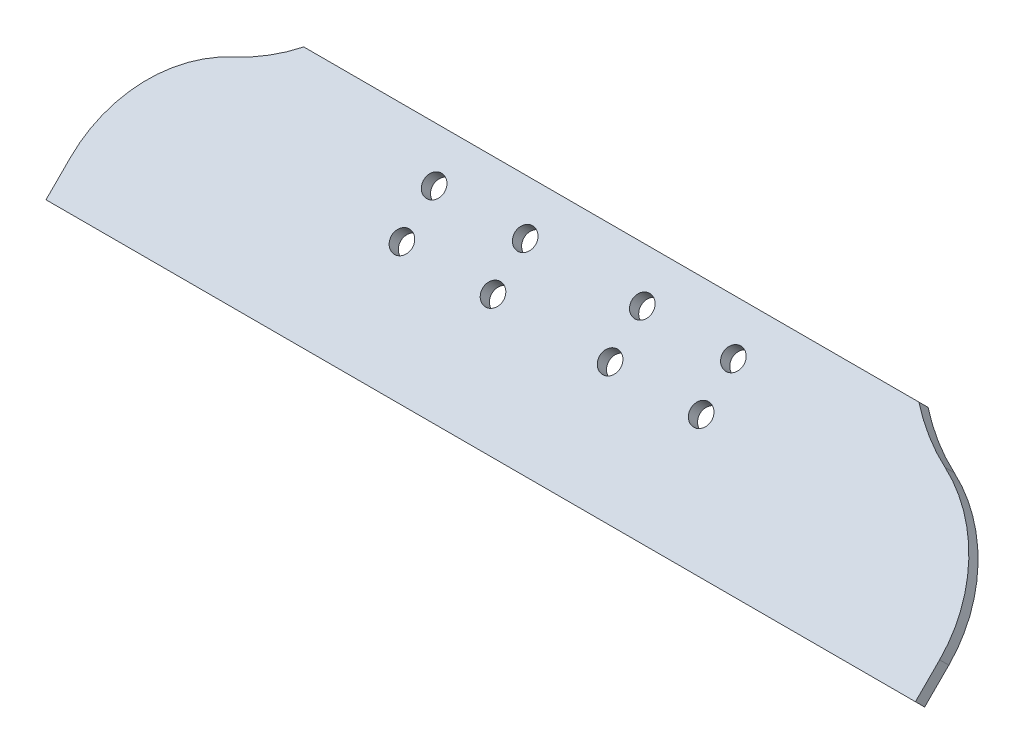
ISO-10303-21;
HEADER;
FILE_DESCRIPTION(('STEP AP214'),'2;1');
FILE_NAME('part.step','',(''),(''),'','','');
FILE_SCHEMA(('AUTOMOTIVE_DESIGN { 1 0 10303 214 1 1 1 1 }'));
ENDSEC;
DATA;
#1=APPLICATION_CONTEXT('core data for automotive mechanical design processes');
#2=APPLICATION_PROTOCOL_DEFINITION('international standard','automotive_design',2000,#1);
#3=PRODUCT_CONTEXT('',#1,'mechanical');
#4=PRODUCT('Part','Part','',(#3));
#5=PRODUCT_RELATED_PRODUCT_CATEGORY('part','',(#4));
#6=PRODUCT_DEFINITION_FORMATION('','',#4);
#7=PRODUCT_DEFINITION_CONTEXT('part definition',#1,'design');
#8=PRODUCT_DEFINITION('design','',#6,#7);
#9=PRODUCT_DEFINITION_SHAPE('','',#8);
#10=(LENGTH_UNIT() NAMED_UNIT(*) SI_UNIT(.MILLI.,.METRE.));
#11=(NAMED_UNIT(*) PLANE_ANGLE_UNIT() SI_UNIT($,.RADIAN.));
#12=(NAMED_UNIT(*) SI_UNIT($,.STERADIAN.) SOLID_ANGLE_UNIT());
#13=UNCERTAINTY_MEASURE_WITH_UNIT(LENGTH_MEASURE(1.E-05),#10,'distance_accuracy_value','');
#14=(GEOMETRIC_REPRESENTATION_CONTEXT(3) GLOBAL_UNCERTAINTY_ASSIGNED_CONTEXT((#13)) GLOBAL_UNIT_ASSIGNED_CONTEXT((#10,
#11,#12)) REPRESENTATION_CONTEXT('',''));
#15=CARTESIAN_POINT('',(0.,0.,0.));
#16=DIRECTION('',(0.,0.,1.));
#17=DIRECTION('',(1.,0.,0.));
#18=AXIS2_PLACEMENT_3D('',#15,#16,#17);
#19=CARTESIAN_POINT('',(74.3401280605345,5.90533644918669,66.8472916113481));
#20=DIRECTION('',(0.,0.707106781186551,0.707106781186544));
#21=DIRECTION('',(0.,-0.707106781186544,0.707106781186551));
#22=AXIS2_PLACEMENT_3D('',#19,#20,#21);
#23=PLANE('',#22);
#24=CARTESIAN_POINT('',(-36.5125,17.2869930330582,55.4656350274765));
#25=DIRECTION('',(0.,0.707106781186551,0.707106781186544));
#26=DIRECTION('',(0.,-0.707106781186544,0.707106781186551));
#27=AXIS2_PLACEMENT_3D('',#24,#25,#26);
#28=CIRCLE('',#27,2.5527);
#29=CARTESIAN_POINT('',(-36.5125,15.4819615527233,57.2706665078114));
#30=VERTEX_POINT('',#29);
#31=EDGE_CURVE('E377',#30,#30,#28,.T.);
#32=ORIENTED_EDGE('',*,*,#31,.F.);
#33=EDGE_LOOP('',(#32));
#34=FACE_BOUND('',#33,.T.);
#35=CARTESIAN_POINT('',(36.5125,25.1447171389936,47.607910921541));
#36=DIRECTION('',(0.,0.707106781186551,0.707106781186544));
#37=DIRECTION('',(0.,-0.707106781186544,0.707106781186551));
#38=AXIS2_PLACEMENT_3D('',#35,#36,#37);
#39=CIRCLE('',#38,2.5527);
#40=CARTESIAN_POINT('',(36.5125,23.3396856586588,49.4129424018759));
#41=VERTEX_POINT('',#40);
#42=EDGE_CURVE('E378',#41,#41,#39,.T.);
#43=ORIENTED_EDGE('',*,*,#42,.F.);
#44=EDGE_LOOP('',(#43));
#45=FACE_BOUND('',#44,.T.);
#46=CARTESIAN_POINT('',(14.2875,25.1447171389936,47.607910921541));
#47=DIRECTION('',(0.,0.707106781186551,0.707106781186544));
#48=DIRECTION('',(0.,-0.707106781186544,0.707106781186551));
#49=AXIS2_PLACEMENT_3D('',#46,#47,#48);
#50=CIRCLE('',#49,2.5527);
#51=CARTESIAN_POINT('',(14.2875,23.3396856586588,49.4129424018759));
#52=VERTEX_POINT('',#51);
#53=EDGE_CURVE('E382',#52,#52,#50,.T.);
#54=ORIENTED_EDGE('',*,*,#53,.F.);
#55=EDGE_LOOP('',(#54));
#56=FACE_BOUND('',#55,.T.);
#57=CARTESIAN_POINT('',(-14.2875,25.1447171389936,47.607910921541));
#58=DIRECTION('',(0.,0.707106781186551,0.707106781186544));
#59=DIRECTION('',(0.,-0.707106781186544,0.707106781186551));
#60=AXIS2_PLACEMENT_3D('',#57,#58,#59);
#61=CIRCLE('',#60,2.5527);
#62=CARTESIAN_POINT('',(-14.2875,23.3396856586588,49.4129424018759));
#63=VERTEX_POINT('',#62);
#64=EDGE_CURVE('E389',#63,#63,#61,.T.);
#65=ORIENTED_EDGE('',*,*,#64,.F.);
#66=EDGE_LOOP('',(#65));
#67=FACE_BOUND('',#66,.T.);
#68=CARTESIAN_POINT('',(-14.2875,17.2869930330582,55.4656350274765));
#69=DIRECTION('',(0.,0.707106781186551,0.707106781186544));
#70=DIRECTION('',(0.,-0.707106781186544,0.707106781186551));
#71=AXIS2_PLACEMENT_3D('',#68,#69,#70);
#72=CIRCLE('',#71,2.5527);
#73=CARTESIAN_POINT('',(-14.2875,15.4819615527233,57.2706665078114));
#74=VERTEX_POINT('',#73);
#75=EDGE_CURVE('E379',#74,#74,#72,.T.);
#76=ORIENTED_EDGE('',*,*,#75,.F.);
#77=EDGE_LOOP('',(#76));
#78=FACE_BOUND('',#77,.T.);
#79=CARTESIAN_POINT('',(14.2875,17.2869930330582,55.4656350274765));
#80=DIRECTION('',(0.,0.707106781186551,0.707106781186544));
#81=DIRECTION('',(0.,-0.707106781186544,0.707106781186551));
#82=AXIS2_PLACEMENT_3D('',#79,#80,#81);
#83=CIRCLE('',#82,2.5527);
#84=CARTESIAN_POINT('',(14.2875,15.4819615527233,57.2706665078114));
#85=VERTEX_POINT('',#84);
#86=EDGE_CURVE('E385',#85,#85,#83,.T.);
#87=ORIENTED_EDGE('',*,*,#86,.F.);
#88=EDGE_LOOP('',(#87));
#89=FACE_BOUND('',#88,.T.);
#90=CARTESIAN_POINT('',(36.5125,17.2869930330582,55.4656350274765));
#91=DIRECTION('',(0.,0.707106781186551,0.707106781186544));
#92=DIRECTION('',(0.,-0.707106781186544,0.707106781186551));
#93=AXIS2_PLACEMENT_3D('',#90,#91,#92);
#94=CIRCLE('',#93,2.5527);
#95=CARTESIAN_POINT('',(36.5125,15.4819615527233,57.2706665078114));
#96=VERTEX_POINT('',#95);
#97=EDGE_CURVE('E406',#96,#96,#94,.T.);
#98=ORIENTED_EDGE('',*,*,#97,.F.);
#99=EDGE_LOOP('',(#98));
#100=FACE_BOUND('',#99,.T.);
#101=CARTESIAN_POINT('',(-36.5125,25.1447171389936,47.607910921541));
#102=DIRECTION('',(0.,0.707106781186551,0.707106781186544));
#103=DIRECTION('',(0.,-0.707106781186544,0.707106781186551));
#104=AXIS2_PLACEMENT_3D('',#101,#102,#103);
#105=CIRCLE('',#104,2.5527);
#106=CARTESIAN_POINT('',(-36.5125,23.3396856586588,49.4129424018759));
#107=VERTEX_POINT('',#106);
#108=EDGE_CURVE('E160',#107,#107,#105,.T.);
#109=ORIENTED_EDGE('',*,*,#108,.F.);
#110=EDGE_LOOP('',(#109));
#111=FACE_BOUND('',#110,.T.);
#112=DIRECTION('',(-1.,0.,0.));
#113=VECTOR('',#112,1.);
#114=CARTESIAN_POINT('',(22.86,31.8799092297955,40.8727188307391));
#115=LINE('',#114,#113);
#116=CARTESIAN_POINT('',(75.0523471244315,31.8799092297955,40.8727188307391));
#117=VERTEX_POINT('',#116);
#118=CARTESIAN_POINT('',(-75.0523471244315,31.8799092297955,40.8727188307391));
#119=VERTEX_POINT('',#118);
#120=EDGE_CURVE('E112',#117,#119,#115,.T.);
#121=ORIENTED_EDGE('',*,*,#120,.T.);
#122=CARTESIAN_POINT('',(-102.892624920902,53.4484360429933,19.304192017541));
#123=DIRECTION('',(0.,-0.707106781186551,-0.707106781186544));
#124=DIRECTION('',(0.,-0.707106781186544,0.707106781186551));
#125=AXIS2_PLACEMENT_3D('',#122,#123,#124);
#126=CIRCLE('',#125,41.2975031396323);
#127=CARTESIAN_POINT('',(-86.7504328122766,26.5698813990383,46.1827466614963));
#128=VERTEX_POINT('',#127);
#129=EDGE_CURVE('E104',#119,#128,#126,.T.);
#130=ORIENTED_EDGE('',*,*,#129,.T.);
#131=CARTESIAN_POINT('',(-74.3401280605345,5.90533644918669,66.8472916113481));
#132=DIRECTION('',(0.,0.707106781186551,0.707106781186544));
#133=DIRECTION('',(0.,-0.707106781186544,0.707106781186551));
#134=AXIS2_PLACEMENT_3D('',#131,#132,#133);
#135=CIRCLE('',#134,31.75);
#136=CARTESIAN_POINT('',(-106.090128060535,5.90533644918669,66.8472916113481));
#137=VERTEX_POINT('',#136);
#138=EDGE_CURVE('E107',#128,#137,#135,.T.);
#139=ORIENTED_EDGE('',*,*,#138,.T.);
#140=DIRECTION('',(0.,-0.707106781186544,0.707106781186551));
#141=VECTOR('',#140,1.);
#142=CARTESIAN_POINT('',(-106.090128060535,5.90533644918669,66.8472916113481));
#143=LINE('',#142,#141);
#144=CARTESIAN_POINT('',(-106.090128060535,1.58293517182884E-13,72.7526280605347));
#145=VERTEX_POINT('',#144);
#146=EDGE_CURVE('E58',#137,#145,#143,.T.);
#147=ORIENTED_EDGE('',*,*,#146,.T.);
#148=DIRECTION('',(1.,0.,0.));
#149=VECTOR('',#148,1.);
#150=CARTESIAN_POINT('',(-106.090128060535,1.58293517182884E-13,72.7526280605347));
#151=LINE('',#150,#149);
#152=CARTESIAN_POINT('',(106.090128060535,1.61762964134837E-13,72.7526280605347));
#153=VERTEX_POINT('',#152);
#154=EDGE_CURVE('E147',#145,#153,#151,.T.);
#155=ORIENTED_EDGE('',*,*,#154,.T.);
#156=DIRECTION('',(0.,0.707106781186543,-0.707106781186552));
#157=VECTOR('',#156,1.);
#158=CARTESIAN_POINT('',(106.090128060535,1.61762964134837E-13,72.7526280605347));
#159=LINE('',#158,#157);
#160=CARTESIAN_POINT('',(106.090128060535,5.90533644918668,66.8472916113481));
#161=VERTEX_POINT('',#160);
#162=EDGE_CURVE('E94',#153,#161,#159,.T.);
#163=ORIENTED_EDGE('',*,*,#162,.T.);
#164=CARTESIAN_POINT('',(74.3401280605345,5.90533644918669,66.8472916113481));
#165=DIRECTION('',(0.,0.707106781186551,0.707106781186544));
#166=DIRECTION('',(0.,-0.707106781186544,0.707106781186551));
#167=AXIS2_PLACEMENT_3D('',#164,#165,#166);
#168=CIRCLE('',#167,31.75);
#169=CARTESIAN_POINT('',(86.7504328122767,26.5698813990383,46.1827466614963));
#170=VERTEX_POINT('',#169);
#171=EDGE_CURVE('E191',#161,#170,#168,.T.);
#172=ORIENTED_EDGE('',*,*,#171,.T.);
#173=CARTESIAN_POINT('',(102.892624920902,53.4484360429933,19.304192017541));
#174=DIRECTION('',(0.,-0.707106781186551,-0.707106781186544));
#175=DIRECTION('',(0.,-0.707106781186544,0.707106781186551));
#176=AXIS2_PLACEMENT_3D('',#173,#174,#175);
#177=CIRCLE('',#176,41.2975031396323);
#178=EDGE_CURVE('E193',#170,#117,#177,.T.);
#179=ORIENTED_EDGE('',*,*,#178,.T.);
#180=EDGE_LOOP('',(#121,#130,#139,#147,#155,#163,#172,#179));
#181=FACE_BOUND('',#180,.T.);
#182=ADVANCED_FACE('F33',(#34,#45,#56,#67,#78,#89,#100,#111,#181),#23,.T.);
#183=CARTESIAN_POINT('',(74.3401280605345,3.66027241891939,64.6022275810809));
#184=DIRECTION('',(0.,0.707106781186551,0.707106781186544));
#185=DIRECTION('',(0.,-0.707106781186544,0.707106781186551));
#186=AXIS2_PLACEMENT_3D('',#183,#184,#185);
#187=PLANE('',#186);
#188=CARTESIAN_POINT('',(-36.5125,15.0419290027909,53.2205709972093));
#189=DIRECTION('',(0.,0.707106781186551,0.707106781186544));
#190=DIRECTION('',(0.,-0.707106781186544,0.707106781186551));
#191=AXIS2_PLACEMENT_3D('',#188,#189,#190);
#192=CIRCLE('',#191,2.5527);
#193=CARTESIAN_POINT('',(-36.5125,13.236897522456,55.0256024775442));
#194=VERTEX_POINT('',#193);
#195=EDGE_CURVE('E37',#194,#194,#192,.T.);
#196=ORIENTED_EDGE('',*,*,#195,.T.);
#197=EDGE_LOOP('',(#196));
#198=FACE_BOUND('',#197,.T.);
#199=CARTESIAN_POINT('',(36.5125,22.8996531087263,45.3628468912737));
#200=DIRECTION('',(0.,0.707106781186551,0.707106781186544));
#201=DIRECTION('',(0.,-0.707106781186544,0.707106781186551));
#202=AXIS2_PLACEMENT_3D('',#199,#200,#201);
#203=CIRCLE('',#202,2.5527);
#204=CARTESIAN_POINT('',(36.5125,21.0946216283914,47.1678783716086));
#205=VERTEX_POINT('',#204);
#206=EDGE_CURVE('E174',#205,#205,#203,.T.);
#207=ORIENTED_EDGE('',*,*,#206,.T.);
#208=EDGE_LOOP('',(#207));
#209=FACE_BOUND('',#208,.T.);
#210=CARTESIAN_POINT('',(14.2875,22.8996531087263,45.3628468912737));
#211=DIRECTION('',(0.,0.707106781186551,0.707106781186544));
#212=DIRECTION('',(0.,-0.707106781186544,0.707106781186551));
#213=AXIS2_PLACEMENT_3D('',#210,#211,#212);
#214=CIRCLE('',#213,2.5527);
#215=CARTESIAN_POINT('',(14.2875,21.0946216283914,47.1678783716086));
#216=VERTEX_POINT('',#215);
#217=EDGE_CURVE('E172',#216,#216,#214,.T.);
#218=ORIENTED_EDGE('',*,*,#217,.T.);
#219=EDGE_LOOP('',(#218));
#220=FACE_BOUND('',#219,.T.);
#221=CARTESIAN_POINT('',(-14.2875,22.8996531087263,45.3628468912737));
#222=DIRECTION('',(0.,0.707106781186551,0.707106781186544));
#223=DIRECTION('',(0.,-0.707106781186544,0.707106781186551));
#224=AXIS2_PLACEMENT_3D('',#221,#222,#223);
#225=CIRCLE('',#224,2.5527);
#226=CARTESIAN_POINT('',(-14.2875,21.0946216283914,47.1678783716086));
#227=VERTEX_POINT('',#226);
#228=EDGE_CURVE('E169',#227,#227,#225,.T.);
#229=ORIENTED_EDGE('',*,*,#228,.T.);
#230=EDGE_LOOP('',(#229));
#231=FACE_BOUND('',#230,.T.);
#232=CARTESIAN_POINT('',(-14.2875,15.0419290027909,53.2205709972093));
#233=DIRECTION('',(0.,0.707106781186551,0.707106781186544));
#234=DIRECTION('',(0.,-0.707106781186544,0.707106781186551));
#235=AXIS2_PLACEMENT_3D('',#232,#233,#234);
#236=CIRCLE('',#235,2.5527);
#237=CARTESIAN_POINT('',(-14.2875,13.236897522456,55.0256024775442));
#238=VERTEX_POINT('',#237);
#239=EDGE_CURVE('E166',#238,#238,#236,.T.);
#240=ORIENTED_EDGE('',*,*,#239,.T.);
#241=EDGE_LOOP('',(#240));
#242=FACE_BOUND('',#241,.T.);
#243=CARTESIAN_POINT('',(14.2875,15.0419290027909,53.2205709972093));
#244=DIRECTION('',(0.,0.707106781186551,0.707106781186544));
#245=DIRECTION('',(0.,-0.707106781186544,0.707106781186551));
#246=AXIS2_PLACEMENT_3D('',#243,#244,#245);
#247=CIRCLE('',#246,2.5527);
#248=CARTESIAN_POINT('',(14.2875,13.236897522456,55.0256024775442));
#249=VERTEX_POINT('',#248);
#250=EDGE_CURVE('E163',#249,#249,#247,.T.);
#251=ORIENTED_EDGE('',*,*,#250,.T.);
#252=EDGE_LOOP('',(#251));
#253=FACE_BOUND('',#252,.T.);
#254=CARTESIAN_POINT('',(36.5125,15.0419290027909,53.2205709972093));
#255=DIRECTION('',(0.,0.707106781186551,0.707106781186544));
#256=DIRECTION('',(0.,-0.707106781186544,0.707106781186551));
#257=AXIS2_PLACEMENT_3D('',#254,#255,#256);
#258=CIRCLE('',#257,2.5527);
#259=CARTESIAN_POINT('',(36.5125,13.236897522456,55.0256024775442));
#260=VERTEX_POINT('',#259);
#261=EDGE_CURVE('E159',#260,#260,#258,.T.);
#262=ORIENTED_EDGE('',*,*,#261,.T.);
#263=EDGE_LOOP('',(#262));
#264=FACE_BOUND('',#263,.T.);
#265=CARTESIAN_POINT('',(-36.5125,22.8996531087263,45.3628468912737));
#266=DIRECTION('',(0.,0.707106781186551,0.707106781186544));
#267=DIRECTION('',(0.,-0.707106781186544,0.707106781186551));
#268=AXIS2_PLACEMENT_3D('',#265,#266,#267);
#269=CIRCLE('',#268,2.5527);
#270=CARTESIAN_POINT('',(-36.5125,21.0946216283914,47.1678783716086));
#271=VERTEX_POINT('',#270);
#272=EDGE_CURVE('E156',#271,#271,#269,.T.);
#273=ORIENTED_EDGE('',*,*,#272,.T.);
#274=EDGE_LOOP('',(#273));
#275=FACE_BOUND('',#274,.T.);
#276=CARTESIAN_POINT('',(-102.892624920902,51.203372012726,17.0591279872737));
#277=DIRECTION('',(0.,-0.707106781186551,-0.707106781186544));
#278=DIRECTION('',(0.,-0.707106781186544,0.707106781186551));
#279=AXIS2_PLACEMENT_3D('',#276,#277,#278);
#280=CIRCLE('',#279,41.2975031396323);
#281=CARTESIAN_POINT('',(-75.0523471244315,29.6348451995282,38.6276548004718));
#282=VERTEX_POINT('',#281);
#283=CARTESIAN_POINT('',(-86.7504328122766,24.324817368771,43.937682631229));
#284=VERTEX_POINT('',#283);
#285=EDGE_CURVE('E119',#282,#284,#280,.T.);
#286=ORIENTED_EDGE('',*,*,#285,.F.);
#287=DIRECTION('',(-1.,0.,0.));
#288=VECTOR('',#287,1.);
#289=CARTESIAN_POINT('',(22.86,29.6348451995282,38.6276548004718));
#290=LINE('',#289,#288);
#291=CARTESIAN_POINT('',(75.0523471244315,29.6348451995282,38.6276548004718));
#292=VERTEX_POINT('',#291);
#293=EDGE_CURVE('E50',#292,#282,#290,.T.);
#294=ORIENTED_EDGE('',*,*,#293,.F.);
#295=CARTESIAN_POINT('',(102.892624920902,51.203372012726,17.0591279872737));
#296=DIRECTION('',(0.,-0.707106781186551,-0.707106781186544));
#297=DIRECTION('',(0.,-0.707106781186544,0.707106781186551));
#298=AXIS2_PLACEMENT_3D('',#295,#296,#297);
#299=CIRCLE('',#298,41.2975031396323);
#300=CARTESIAN_POINT('',(86.7504328122767,24.324817368771,43.937682631229));
#301=VERTEX_POINT('',#300);
#302=EDGE_CURVE('E139',#301,#292,#299,.T.);
#303=ORIENTED_EDGE('',*,*,#302,.F.);
#304=CARTESIAN_POINT('',(74.3401280605345,3.66027241891939,64.6022275810809));
#305=DIRECTION('',(0.,0.707106781186551,0.707106781186544));
#306=DIRECTION('',(0.,-0.707106781186544,0.707106781186551));
#307=AXIS2_PLACEMENT_3D('',#304,#305,#306);
#308=CIRCLE('',#307,31.75);
#309=CARTESIAN_POINT('',(106.090128060535,3.66027241891938,64.6022275810809));
#310=VERTEX_POINT('',#309);
#311=EDGE_CURVE('E137',#310,#301,#308,.T.);
#312=ORIENTED_EDGE('',*,*,#311,.F.);
#313=DIRECTION('',(0.,0.707106781186543,-0.707106781186552));
#314=VECTOR('',#313,1.);
#315=CARTESIAN_POINT('',(106.090128060535,-2.24506403026714,70.5075640302674));
#316=LINE('',#315,#314);
#317=CARTESIAN_POINT('',(106.090128060535,-2.24506403026714,70.5075640302674));
#318=VERTEX_POINT('',#317);
#319=EDGE_CURVE('E134',#318,#310,#316,.T.);
#320=ORIENTED_EDGE('',*,*,#319,.F.);
#321=DIRECTION('',(1.,0.,0.));
#322=VECTOR('',#321,1.);
#323=CARTESIAN_POINT('',(-106.090128060535,-2.24506403026714,70.5075640302674));
#324=LINE('',#323,#322);
#325=CARTESIAN_POINT('',(-106.090128060535,-2.24506403026714,70.5075640302674));
#326=VERTEX_POINT('',#325);
#327=EDGE_CURVE('E131',#326,#318,#324,.T.);
#328=ORIENTED_EDGE('',*,*,#327,.F.);
#329=DIRECTION('',(0.,-0.707106781186544,0.707106781186551));
#330=VECTOR('',#329,1.);
#331=CARTESIAN_POINT('',(-106.090128060535,3.66027241891938,64.6022275810809));
#332=LINE('',#331,#330);
#333=CARTESIAN_POINT('',(-106.090128060535,3.66027241891939,64.6022275810809));
#334=VERTEX_POINT('',#333);
#335=EDGE_CURVE('E85',#334,#326,#332,.T.);
#336=ORIENTED_EDGE('',*,*,#335,.F.);
#337=CARTESIAN_POINT('',(-74.3401280605345,3.66027241891938,64.6022275810809));
#338=DIRECTION('',(0.,0.707106781186551,0.707106781186544));
#339=DIRECTION('',(0.,-0.707106781186544,0.707106781186551));
#340=AXIS2_PLACEMENT_3D('',#337,#338,#339);
#341=CIRCLE('',#340,31.75);
#342=EDGE_CURVE('E144',#284,#334,#341,.T.);
#343=ORIENTED_EDGE('',*,*,#342,.F.);
#344=EDGE_LOOP('',(#286,#294,#303,#312,#320,#328,#336,#343));
#345=FACE_BOUND('',#344,.T.);
#346=ADVANCED_FACE('F201',(#198,#209,#220,#231,#242,#253,#264,#275,#345),#187,.F.);
#347=CARTESIAN_POINT('',(-106.090128060535,1.58293517182884E-13,72.7526280605347));
#348=DIRECTION('',(0.,0.707106781186543,-0.707106781186551));
#349=DIRECTION('',(0.,0.707106781186551,0.707106781186544));
#350=AXIS2_PLACEMENT_3D('',#347,#348,#349);
#351=PLANE('',#350);
#352=ORIENTED_EDGE('',*,*,#327,.T.);
#353=DIRECTION('',(0.,-0.707106781186551,-0.707106781186543));
#354=VECTOR('',#353,1.);
#355=CARTESIAN_POINT('',(106.090128060535,1.61762964134837E-13,72.7526280605347));
#356=LINE('',#355,#354);
#357=EDGE_CURVE('E42',#153,#318,#356,.T.);
#358=ORIENTED_EDGE('',*,*,#357,.F.);
#359=ORIENTED_EDGE('',*,*,#154,.F.);
#360=DIRECTION('',(0.,-0.707106781186551,-0.707106781186543));
#361=VECTOR('',#360,1.);
#362=CARTESIAN_POINT('',(-106.090128060535,1.58293517182884E-13,72.7526280605347));
#363=LINE('',#362,#361);
#364=EDGE_CURVE('E127',#145,#326,#363,.T.);
#365=ORIENTED_EDGE('',*,*,#364,.T.);
#366=EDGE_LOOP('',(#352,#358,#359,#365));
#367=FACE_BOUND('',#366,.T.);
#368=ADVANCED_FACE('F35',(#367),#351,.F.);
#369=CARTESIAN_POINT('',(106.090128060535,1.61762964134837E-13,72.7526280605347));
#370=DIRECTION('',(-1.,0.,0.));
#371=DIRECTION('',(0.,0.,1.));
#372=AXIS2_PLACEMENT_3D('',#369,#370,#371);
#373=PLANE('',#372);
#374=ORIENTED_EDGE('',*,*,#319,.T.);
#375=DIRECTION('',(0.,-0.707106781186551,-0.707106781186543));
#376=VECTOR('',#375,1.);
#377=CARTESIAN_POINT('',(106.090128060535,5.90533644918668,66.8472916113481));
#378=LINE('',#377,#376);
#379=EDGE_CURVE('E152',#161,#310,#378,.T.);
#380=ORIENTED_EDGE('',*,*,#379,.F.);
#381=ORIENTED_EDGE('',*,*,#162,.F.);
#382=ORIENTED_EDGE('',*,*,#357,.T.);
#383=EDGE_LOOP('',(#374,#380,#381,#382));
#384=FACE_BOUND('',#383,.T.);
#385=ADVANCED_FACE('F318',(#384),#373,.F.);
#386=CARTESIAN_POINT('',(74.3401280605345,5.90533644918669,66.8472916113481));
#387=DIRECTION('',(0.,-0.707106781186551,-0.707106781186543));
#388=DIRECTION('',(0.,0.707106781186544,-0.707106781186551));
#389=AXIS2_PLACEMENT_3D('',#386,#387,#388);
#390=CYLINDRICAL_SURFACE('',#389,31.75);
#391=ORIENTED_EDGE('',*,*,#311,.T.);
#392=DIRECTION('',(0.,-0.707106781186551,-0.707106781186543));
#393=VECTOR('',#392,1.);
#394=CARTESIAN_POINT('',(86.7504328122767,26.5698813990383,46.1827466614963));
#395=LINE('',#394,#393);
#396=EDGE_CURVE('E122',#170,#301,#395,.T.);
#397=ORIENTED_EDGE('',*,*,#396,.F.);
#398=ORIENTED_EDGE('',*,*,#171,.F.);
#399=ORIENTED_EDGE('',*,*,#379,.T.);
#400=EDGE_LOOP('',(#391,#397,#398,#399));
#401=FACE_BOUND('',#400,.T.);
#402=ADVANCED_FACE('F211',(#401),#390,.T.);
#403=CARTESIAN_POINT('',(102.892624920902,53.4484360429933,19.304192017541));
#404=DIRECTION('',(0.,-0.707106781186551,-0.707106781186543));
#405=DIRECTION('',(0.,0.707106781186544,-0.707106781186551));
#406=AXIS2_PLACEMENT_3D('',#403,#404,#405);
#407=CYLINDRICAL_SURFACE('',#406,41.2975031396323);
#408=ORIENTED_EDGE('',*,*,#302,.T.);
#409=DIRECTION('',(0.,0.707106781186551,0.707106781186544));
#410=VECTOR('',#409,1.);
#411=CARTESIAN_POINT('',(75.0523471244315,-27.0501868156056,-18.0573772146613));
#412=LINE('',#411,#410);
#413=EDGE_CURVE('E135',#292,#117,#412,.T.);
#414=ORIENTED_EDGE('',*,*,#413,.T.);
#415=ORIENTED_EDGE('',*,*,#178,.F.);
#416=ORIENTED_EDGE('',*,*,#396,.T.);
#417=EDGE_LOOP('',(#408,#414,#415,#416));
#418=FACE_BOUND('',#417,.T.);
#419=ADVANCED_FACE('F196',(#418),#407,.F.);
#420=CARTESIAN_POINT('',(22.86,31.8799092297955,40.8727188307391));
#421=DIRECTION('',(0.,-0.707106781186543,0.707106781186551));
#422=DIRECTION('',(0.,-0.707106781186551,-0.707106781186544));
#423=AXIS2_PLACEMENT_3D('',#420,#421,#422);
#424=PLANE('',#423);
#425=ORIENTED_EDGE('',*,*,#293,.T.);
#426=DIRECTION('',(0.,-0.707106781186551,-0.707106781186543));
#427=VECTOR('',#426,1.);
#428=CARTESIAN_POINT('',(-75.0523471244315,31.8799092297955,40.8727188307391));
#429=LINE('',#428,#427);
#430=EDGE_CURVE('E11',#119,#282,#429,.T.);
#431=ORIENTED_EDGE('',*,*,#430,.F.);
#432=ORIENTED_EDGE('',*,*,#120,.F.);
#433=ORIENTED_EDGE('',*,*,#413,.F.);
#434=EDGE_LOOP('',(#425,#431,#432,#433));
#435=FACE_BOUND('',#434,.T.);
#436=ADVANCED_FACE('F202',(#435),#424,.F.);
#437=CARTESIAN_POINT('',(-102.892624920902,53.4484360429933,19.304192017541));
#438=DIRECTION('',(0.,-0.707106781186551,-0.707106781186543));
#439=DIRECTION('',(0.,0.707106781186544,-0.707106781186551));
#440=AXIS2_PLACEMENT_3D('',#437,#438,#439);
#441=CYLINDRICAL_SURFACE('',#440,41.2975031396323);
#442=ORIENTED_EDGE('',*,*,#129,.F.);
#443=ORIENTED_EDGE('',*,*,#430,.T.);
#444=ORIENTED_EDGE('',*,*,#285,.T.);
#445=DIRECTION('',(0.,-0.707106781186551,-0.707106781186543));
#446=VECTOR('',#445,1.);
#447=CARTESIAN_POINT('',(-86.7504328122766,26.5698813990383,46.1827466614963));
#448=LINE('',#447,#446);
#449=EDGE_CURVE('E116',#128,#284,#448,.T.);
#450=ORIENTED_EDGE('',*,*,#449,.F.);
#451=EDGE_LOOP('',(#442,#443,#444,#450));
#452=FACE_BOUND('',#451,.T.);
#453=ADVANCED_FACE('F117',(#452),#441,.F.);
#454=CARTESIAN_POINT('',(-74.3401280605345,5.90533644918669,66.8472916113481));
#455=DIRECTION('',(0.,-0.707106781186551,-0.707106781186543));
#456=DIRECTION('',(0.,0.707106781186544,-0.707106781186551));
#457=AXIS2_PLACEMENT_3D('',#454,#455,#456);
#458=CYLINDRICAL_SURFACE('',#457,31.75);
#459=ORIENTED_EDGE('',*,*,#342,.T.);
#460=DIRECTION('',(0.,-0.707106781186551,-0.707106781186543));
#461=VECTOR('',#460,1.);
#462=CARTESIAN_POINT('',(-106.090128060535,5.90533644918669,66.8472916113481));
#463=LINE('',#462,#461);
#464=EDGE_CURVE('E123',#137,#334,#463,.T.);
#465=ORIENTED_EDGE('',*,*,#464,.F.);
#466=ORIENTED_EDGE('',*,*,#138,.F.);
#467=ORIENTED_EDGE('',*,*,#449,.T.);
#468=EDGE_LOOP('',(#459,#465,#466,#467));
#469=FACE_BOUND('',#468,.T.);
#470=ADVANCED_FACE('F125',(#469),#458,.T.);
#471=CARTESIAN_POINT('',(-106.090128060535,5.90533644918669,66.8472916113481));
#472=DIRECTION('',(1.,0.,0.));
#473=DIRECTION('',(0.,0.,-1.));
#474=AXIS2_PLACEMENT_3D('',#471,#472,#473);
#475=PLANE('',#474);
#476=ORIENTED_EDGE('',*,*,#335,.T.);
#477=ORIENTED_EDGE('',*,*,#364,.F.);
#478=ORIENTED_EDGE('',*,*,#146,.F.);
#479=ORIENTED_EDGE('',*,*,#464,.T.);
#480=EDGE_LOOP('',(#476,#477,#478,#479));
#481=FACE_BOUND('',#480,.T.);
#482=ADVANCED_FACE('F226',(#481),#475,.F.);
#483=CARTESIAN_POINT('',(-36.5125,-33.7853789064074,-11.3221851238594));
#484=DIRECTION('',(0.,0.707106781186551,0.707106781186544));
#485=DIRECTION('',(0.,-0.707106781186544,0.707106781186551));
#486=AXIS2_PLACEMENT_3D('',#483,#484,#485);
#487=CYLINDRICAL_SURFACE('',#486,2.5527);
#488=ORIENTED_EDGE('',*,*,#108,.T.);
#489=EDGE_LOOP('',(#488));
#490=FACE_BOUND('',#489,.T.);
#491=ORIENTED_EDGE('',*,*,#272,.F.);
#492=EDGE_LOOP('',(#491));
#493=FACE_BOUND('',#492,.T.);
#494=ADVANCED_FACE('F223',(#490,#493),#487,.F.);
#495=CARTESIAN_POINT('',(36.5125,-41.6431030123429,-3.46446101792386));
#496=DIRECTION('',(0.,0.707106781186551,0.707106781186544));
#497=DIRECTION('',(0.,-0.707106781186544,0.707106781186551));
#498=AXIS2_PLACEMENT_3D('',#495,#496,#497);
#499=CYLINDRICAL_SURFACE('',#498,2.5527);
#500=ORIENTED_EDGE('',*,*,#97,.T.);
#501=EDGE_LOOP('',(#500));
#502=FACE_BOUND('',#501,.T.);
#503=ORIENTED_EDGE('',*,*,#261,.F.);
#504=EDGE_LOOP('',(#503));
#505=FACE_BOUND('',#504,.T.);
#506=ADVANCED_FACE('F246',(#502,#505),#499,.F.);
#507=CARTESIAN_POINT('',(14.2875,-41.6431030123429,-3.46446101792386));
#508=DIRECTION('',(0.,0.707106781186551,0.707106781186544));
#509=DIRECTION('',(0.,-0.707106781186544,0.707106781186551));
#510=AXIS2_PLACEMENT_3D('',#507,#508,#509);
#511=CYLINDRICAL_SURFACE('',#510,2.5527);
#512=ORIENTED_EDGE('',*,*,#86,.T.);
#513=EDGE_LOOP('',(#512));
#514=FACE_BOUND('',#513,.T.);
#515=ORIENTED_EDGE('',*,*,#250,.F.);
#516=EDGE_LOOP('',(#515));
#517=FACE_BOUND('',#516,.T.);
#518=ADVANCED_FACE('F254',(#514,#517),#511,.F.);
#519=CARTESIAN_POINT('',(-14.2875,-41.6431030123429,-3.46446101792386));
#520=DIRECTION('',(0.,0.707106781186551,0.707106781186544));
#521=DIRECTION('',(0.,-0.707106781186544,0.707106781186551));
#522=AXIS2_PLACEMENT_3D('',#519,#520,#521);
#523=CYLINDRICAL_SURFACE('',#522,2.5527);
#524=ORIENTED_EDGE('',*,*,#75,.T.);
#525=EDGE_LOOP('',(#524));
#526=FACE_BOUND('',#525,.T.);
#527=ORIENTED_EDGE('',*,*,#239,.F.);
#528=EDGE_LOOP('',(#527));
#529=FACE_BOUND('',#528,.T.);
#530=ADVANCED_FACE('F263',(#526,#529),#523,.F.);
#531=CARTESIAN_POINT('',(-14.2875,-33.7853789064074,-11.3221851238594));
#532=DIRECTION('',(0.,0.707106781186551,0.707106781186544));
#533=DIRECTION('',(0.,-0.707106781186544,0.707106781186551));
#534=AXIS2_PLACEMENT_3D('',#531,#532,#533);
#535=CYLINDRICAL_SURFACE('',#534,2.5527);
#536=ORIENTED_EDGE('',*,*,#64,.T.);
#537=EDGE_LOOP('',(#536));
#538=FACE_BOUND('',#537,.T.);
#539=ORIENTED_EDGE('',*,*,#228,.F.);
#540=EDGE_LOOP('',(#539));
#541=FACE_BOUND('',#540,.T.);
#542=ADVANCED_FACE('F272',(#538,#541),#535,.F.);
#543=CARTESIAN_POINT('',(14.2875,-33.7853789064074,-11.3221851238594));
#544=DIRECTION('',(0.,0.707106781186551,0.707106781186544));
#545=DIRECTION('',(0.,-0.707106781186544,0.707106781186551));
#546=AXIS2_PLACEMENT_3D('',#543,#544,#545);
#547=CYLINDRICAL_SURFACE('',#546,2.5527);
#548=ORIENTED_EDGE('',*,*,#53,.T.);
#549=EDGE_LOOP('',(#548));
#550=FACE_BOUND('',#549,.T.);
#551=ORIENTED_EDGE('',*,*,#217,.F.);
#552=EDGE_LOOP('',(#551));
#553=FACE_BOUND('',#552,.T.);
#554=ADVANCED_FACE('F281',(#550,#553),#547,.F.);
#555=CARTESIAN_POINT('',(36.5125,-33.7853789064074,-11.3221851238594));
#556=DIRECTION('',(0.,0.707106781186551,0.707106781186544));
#557=DIRECTION('',(0.,-0.707106781186544,0.707106781186551));
#558=AXIS2_PLACEMENT_3D('',#555,#556,#557);
#559=CYLINDRICAL_SURFACE('',#558,2.5527);
#560=ORIENTED_EDGE('',*,*,#42,.T.);
#561=EDGE_LOOP('',(#560));
#562=FACE_BOUND('',#561,.T.);
#563=ORIENTED_EDGE('',*,*,#206,.F.);
#564=EDGE_LOOP('',(#563));
#565=FACE_BOUND('',#564,.T.);
#566=ADVANCED_FACE('F290',(#562,#565),#559,.F.);
#567=CARTESIAN_POINT('',(-36.5125,-41.6431030123429,-3.46446101792386));
#568=DIRECTION('',(0.,0.707106781186551,0.707106781186544));
#569=DIRECTION('',(0.,-0.707106781186544,0.707106781186551));
#570=AXIS2_PLACEMENT_3D('',#567,#568,#569);
#571=CYLINDRICAL_SURFACE('',#570,2.5527);
#572=ORIENTED_EDGE('',*,*,#31,.T.);
#573=EDGE_LOOP('',(#572));
#574=FACE_BOUND('',#573,.T.);
#575=ORIENTED_EDGE('',*,*,#195,.F.);
#576=EDGE_LOOP('',(#575));
#577=FACE_BOUND('',#576,.T.);
#578=ADVANCED_FACE('F298',(#574,#577),#571,.F.);
#579=CLOSED_SHELL('',(#182,#346,#368,#385,#402,#419,#436,#453,#470,#482,#494,#506,#518,#530,
#542,#554,#566,#578));
#580=MANIFOLD_SOLID_BREP('B2',#579);
#581=ADVANCED_BREP_SHAPE_REPRESENTATION('',(#18,#580),#14);
#582=SHAPE_DEFINITION_REPRESENTATION(#9,#581);
ENDSEC;
END-ISO-10303-21;
